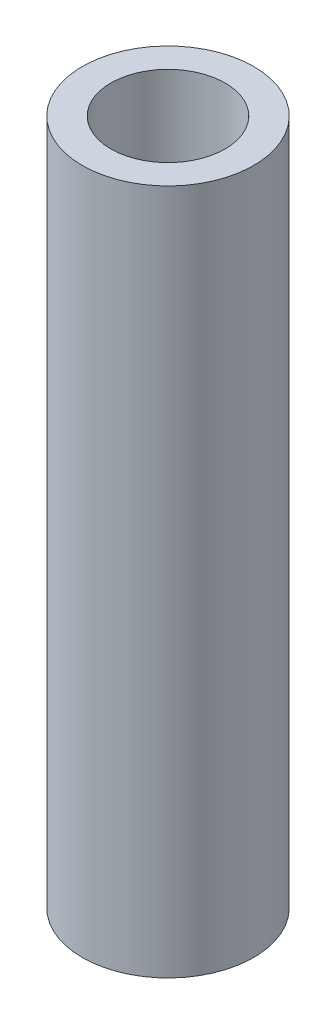
ISO-10303-21;
HEADER;
FILE_DESCRIPTION(('STEP AP214'),'2;1');
FILE_NAME('part.step','',(''),(''),'','','');
FILE_SCHEMA(('AUTOMOTIVE_DESIGN { 1 0 10303 214 1 1 1 1 }'));
ENDSEC;
DATA;
#1=APPLICATION_CONTEXT('core data for automotive mechanical design processes');
#2=APPLICATION_PROTOCOL_DEFINITION('international standard','automotive_design',2000,#1);
#3=PRODUCT_CONTEXT('',#1,'mechanical');
#4=PRODUCT('Part','Part','',(#3));
#5=PRODUCT_RELATED_PRODUCT_CATEGORY('part','',(#4));
#6=PRODUCT_DEFINITION_FORMATION('','',#4);
#7=PRODUCT_DEFINITION_CONTEXT('part definition',#1,'design');
#8=PRODUCT_DEFINITION('design','',#6,#7);
#9=PRODUCT_DEFINITION_SHAPE('','',#8);
#10=(LENGTH_UNIT() NAMED_UNIT(*) SI_UNIT(.MILLI.,.METRE.));
#11=(NAMED_UNIT(*) PLANE_ANGLE_UNIT() SI_UNIT($,.RADIAN.));
#12=(NAMED_UNIT(*) SI_UNIT($,.STERADIAN.) SOLID_ANGLE_UNIT());
#13=UNCERTAINTY_MEASURE_WITH_UNIT(LENGTH_MEASURE(1.E-05),#10,'distance_accuracy_value','');
#14=(GEOMETRIC_REPRESENTATION_CONTEXT(3) GLOBAL_UNCERTAINTY_ASSIGNED_CONTEXT((#13)) GLOBAL_UNIT_ASSIGNED_CONTEXT((#10,
#11,#12)) REPRESENTATION_CONTEXT('',''));
#15=CARTESIAN_POINT('',(0.,0.,0.));
#16=DIRECTION('',(0.,0.,1.));
#17=DIRECTION('',(1.,0.,0.));
#18=AXIS2_PLACEMENT_3D('',#15,#16,#17);
#19=CARTESIAN_POINT('',(0.,60.,0.));
#20=DIRECTION('',(0.,-1.,0.));
#21=DIRECTION('',(0.,0.,-1.));
#22=AXIS2_PLACEMENT_3D('',#19,#20,#21);
#23=CYLINDRICAL_SURFACE('',#22,7.5);
#24=CARTESIAN_POINT('',(0.,19.875,0.));
#25=DIRECTION('',(0.,-1.,0.));
#26=DIRECTION('',(0.,0.,-1.));
#27=AXIS2_PLACEMENT_3D('',#24,#25,#26);
#28=CIRCLE('',#27,7.5);
#29=CARTESIAN_POINT('',(-2.625,19.875,-7.0256227481982));
#30=VERTEX_POINT('',#29);
#31=CARTESIAN_POINT('',(2.625,19.875,-7.0256227481982));
#32=VERTEX_POINT('',#31);
#33=EDGE_CURVE('E113',#30,#32,#28,.T.);
#34=ORIENTED_EDGE('',*,*,#33,.T.);
#35=DIRECTION('',(0.,-1.,0.));
#36=VECTOR('',#35,1.);
#37=CARTESIAN_POINT('',(2.625,60.,-7.0256227481982));
#38=LINE('',#37,#36);
#39=CARTESIAN_POINT('',(2.625,40.125,-7.0256227481982));
#40=VERTEX_POINT('',#39);
#41=EDGE_CURVE('E11',#32,#40,#38,.F.);
#42=ORIENTED_EDGE('',*,*,#41,.T.);
#43=CARTESIAN_POINT('',(0.,40.125,0.));
#44=DIRECTION('',(0.,1.,0.));
#45=DIRECTION('',(0.,0.,1.));
#46=AXIS2_PLACEMENT_3D('',#43,#44,#45);
#47=CIRCLE('',#46,7.5);
#48=CARTESIAN_POINT('',(-2.625,40.125,-7.0256227481982));
#49=VERTEX_POINT('',#48);
#50=EDGE_CURVE('E40',#40,#49,#47,.T.);
#51=ORIENTED_EDGE('',*,*,#50,.T.);
#52=DIRECTION('',(0.,-1.,0.));
#53=VECTOR('',#52,1.);
#54=CARTESIAN_POINT('',(-2.625,60.,-7.0256227481982));
#55=LINE('',#54,#53);
#56=EDGE_CURVE('E54',#49,#30,#55,.T.);
#57=ORIENTED_EDGE('',*,*,#56,.T.);
#58=EDGE_LOOP('',(#34,#42,#51,#57));
#59=FACE_BOUND('',#58,.T.);
#60=CARTESIAN_POINT('',(0.,60.,0.));
#61=DIRECTION('',(0.,1.,0.));
#62=DIRECTION('',(0.,0.,1.));
#63=AXIS2_PLACEMENT_3D('',#60,#61,#62);
#64=CIRCLE('',#63,7.5);
#65=CARTESIAN_POINT('',(0.,60.,7.5));
#66=VERTEX_POINT('',#65);
#67=EDGE_CURVE('E110',#66,#66,#64,.T.);
#68=ORIENTED_EDGE('',*,*,#67,.F.);
#69=EDGE_LOOP('',(#68));
#70=FACE_BOUND('',#69,.T.);
#71=CARTESIAN_POINT('',(0.,0.,0.));
#72=DIRECTION('',(0.,1.,0.));
#73=DIRECTION('',(0.,0.,1.));
#74=AXIS2_PLACEMENT_3D('',#71,#72,#73);
#75=CIRCLE('',#74,7.5);
#76=CARTESIAN_POINT('',(0.,0.,7.5));
#77=VERTEX_POINT('',#76);
#78=EDGE_CURVE('E107',#77,#77,#75,.T.);
#79=ORIENTED_EDGE('',*,*,#78,.T.);
#80=EDGE_LOOP('',(#79));
#81=FACE_BOUND('',#80,.T.);
#82=ADVANCED_FACE('F33',(#59,#70,#81),#23,.T.);
#83=CARTESIAN_POINT('',(0.,60.,0.));
#84=DIRECTION('',(0.,1.,0.));
#85=DIRECTION('',(0.,0.,1.));
#86=AXIS2_PLACEMENT_3D('',#83,#84,#85);
#87=PLANE('',#86);
#88=CARTESIAN_POINT('',(0.,60.,0.));
#89=DIRECTION('',(0.,1.,0.));
#90=DIRECTION('',(0.,0.,1.));
#91=AXIS2_PLACEMENT_3D('',#88,#89,#90);
#92=CIRCLE('',#91,5.);
#93=CARTESIAN_POINT('',(0.,60.,5.));
#94=VERTEX_POINT('',#93);
#95=EDGE_CURVE('E100',#94,#94,#92,.T.);
#96=ORIENTED_EDGE('',*,*,#95,.F.);
#97=EDGE_LOOP('',(#96));
#98=FACE_BOUND('',#97,.T.);
#99=ORIENTED_EDGE('',*,*,#67,.T.);
#100=EDGE_LOOP('',(#99));
#101=FACE_BOUND('',#100,.T.);
#102=ADVANCED_FACE('F132',(#98,#101),#87,.T.);
#103=CARTESIAN_POINT('',(0.,0.,0.));
#104=DIRECTION('',(0.,1.,0.));
#105=DIRECTION('',(0.,0.,1.));
#106=AXIS2_PLACEMENT_3D('',#103,#104,#105);
#107=PLANE('',#106);
#108=ORIENTED_EDGE('',*,*,#78,.F.);
#109=EDGE_LOOP('',(#108));
#110=FACE_BOUND('',#109,.T.);
#111=ADVANCED_FACE('F136',(#110),#107,.F.);
#112=CARTESIAN_POINT('',(0.,45.,0.));
#113=DIRECTION('',(0.,1.,0.));
#114=DIRECTION('',(0.,0.,1.));
#115=AXIS2_PLACEMENT_3D('',#112,#113,#114);
#116=CYLINDRICAL_SURFACE('',#115,5.);
#117=CARTESIAN_POINT('',(0.,45.,0.));
#118=DIRECTION('',(0.,1.,0.));
#119=DIRECTION('',(0.,0.,1.));
#120=AXIS2_PLACEMENT_3D('',#117,#118,#119);
#121=CIRCLE('',#120,5.);
#122=CARTESIAN_POINT('',(0.,45.,5.));
#123=VERTEX_POINT('',#122);
#124=EDGE_CURVE('E104',#123,#123,#121,.T.);
#125=ORIENTED_EDGE('',*,*,#124,.F.);
#126=EDGE_LOOP('',(#125));
#127=FACE_BOUND('',#126,.T.);
#128=ORIENTED_EDGE('',*,*,#95,.T.);
#129=EDGE_LOOP('',(#128));
#130=FACE_BOUND('',#129,.T.);
#131=ADVANCED_FACE('F142',(#127,#130),#116,.F.);
#132=CARTESIAN_POINT('',(0.,45.,0.));
#133=DIRECTION('',(0.,1.,0.));
#134=DIRECTION('',(0.,0.,1.));
#135=AXIS2_PLACEMENT_3D('',#132,#133,#134);
#136=PLANE('',#135);
#137=ORIENTED_EDGE('',*,*,#124,.T.);
#138=EDGE_LOOP('',(#137));
#139=FACE_BOUND('',#138,.T.);
#140=ADVANCED_FACE('F128',(#139),#136,.T.);
#141=CARTESIAN_POINT('',(2.625,19.875,0.));
#142=DIRECTION('',(1.,0.,0.));
#143=DIRECTION('',(0.,1.,0.));
#144=AXIS2_PLACEMENT_3D('',#141,#142,#143);
#145=PLANE('',#144);
#146=DIRECTION('',(0.,0.,-1.));
#147=VECTOR('',#146,1.);
#148=CARTESIAN_POINT('',(2.625,19.875,0.));
#149=LINE('',#148,#147);
#150=CARTESIAN_POINT('',(2.625,19.875,0.));
#151=VERTEX_POINT('',#150);
#152=EDGE_CURVE('E74',#151,#32,#149,.T.);
#153=ORIENTED_EDGE('',*,*,#152,.F.);
#154=DIRECTION('',(0.,-1.,0.));
#155=VECTOR('',#154,1.);
#156=CARTESIAN_POINT('',(2.625,19.875,0.));
#157=LINE('',#156,#155);
#158=CARTESIAN_POINT('',(2.625,40.125,0.));
#159=VERTEX_POINT('',#158);
#160=EDGE_CURVE('E78',#159,#151,#157,.T.);
#161=ORIENTED_EDGE('',*,*,#160,.F.);
#162=DIRECTION('',(0.,0.,-1.));
#163=VECTOR('',#162,1.);
#164=CARTESIAN_POINT('',(2.625,40.125,0.));
#165=LINE('',#164,#163);
#166=EDGE_CURVE('E98',#159,#40,#165,.T.);
#167=ORIENTED_EDGE('',*,*,#166,.T.);
#168=ORIENTED_EDGE('',*,*,#41,.F.);
#169=EDGE_LOOP('',(#153,#161,#167,#168));
#170=FACE_BOUND('',#169,.T.);
#171=ADVANCED_FACE('F76',(#170),#145,.F.);
#172=CARTESIAN_POINT('',(-2.625,40.125,0.));
#173=DIRECTION('',(0.,1.,0.));
#174=DIRECTION('',(0.,0.,1.));
#175=AXIS2_PLACEMENT_3D('',#172,#173,#174);
#176=PLANE('',#175);
#177=ORIENTED_EDGE('',*,*,#166,.F.);
#178=DIRECTION('',(1.,0.,0.));
#179=VECTOR('',#178,1.);
#180=CARTESIAN_POINT('',(-2.625,40.125,0.));
#181=LINE('',#180,#179);
#182=CARTESIAN_POINT('',(-2.625,40.125,0.));
#183=VERTEX_POINT('',#182);
#184=EDGE_CURVE('E82',#183,#159,#181,.T.);
#185=ORIENTED_EDGE('',*,*,#184,.F.);
#186=DIRECTION('',(0.,0.,-1.));
#187=VECTOR('',#186,1.);
#188=CARTESIAN_POINT('',(-2.625,40.125,0.));
#189=LINE('',#188,#187);
#190=EDGE_CURVE('E101',#183,#49,#189,.T.);
#191=ORIENTED_EDGE('',*,*,#190,.T.);
#192=ORIENTED_EDGE('',*,*,#50,.F.);
#193=EDGE_LOOP('',(#177,#185,#191,#192));
#194=FACE_BOUND('',#193,.T.);
#195=ADVANCED_FACE('F120',(#194),#176,.F.);
#196=CARTESIAN_POINT('',(-2.625,19.875,0.));
#197=DIRECTION('',(-1.,0.,0.));
#198=DIRECTION('',(0.,0.,1.));
#199=AXIS2_PLACEMENT_3D('',#196,#197,#198);
#200=PLANE('',#199);
#201=ORIENTED_EDGE('',*,*,#190,.F.);
#202=DIRECTION('',(0.,1.,0.));
#203=VECTOR('',#202,1.);
#204=CARTESIAN_POINT('',(-2.625,19.875,0.));
#205=LINE('',#204,#203);
#206=CARTESIAN_POINT('',(-2.625,19.875,0.));
#207=VERTEX_POINT('',#206);
#208=EDGE_CURVE('E90',#207,#183,#205,.T.);
#209=ORIENTED_EDGE('',*,*,#208,.F.);
#210=DIRECTION('',(0.,0.,-1.));
#211=VECTOR('',#210,1.);
#212=CARTESIAN_POINT('',(-2.625,19.875,0.));
#213=LINE('',#212,#211);
#214=EDGE_CURVE('E81',#207,#30,#213,.T.);
#215=ORIENTED_EDGE('',*,*,#214,.T.);
#216=ORIENTED_EDGE('',*,*,#56,.F.);
#217=EDGE_LOOP('',(#201,#209,#215,#216));
#218=FACE_BOUND('',#217,.T.);
#219=ADVANCED_FACE('F119',(#218),#200,.F.);
#220=CARTESIAN_POINT('',(-2.625,19.875,0.));
#221=DIRECTION('',(0.,-1.,0.));
#222=DIRECTION('',(0.,0.,-1.));
#223=AXIS2_PLACEMENT_3D('',#220,#221,#222);
#224=PLANE('',#223);
#225=ORIENTED_EDGE('',*,*,#33,.F.);
#226=ORIENTED_EDGE('',*,*,#214,.F.);
#227=DIRECTION('',(-1.,0.,0.));
#228=VECTOR('',#227,1.);
#229=CARTESIAN_POINT('',(-2.625,19.875,0.));
#230=LINE('',#229,#228);
#231=EDGE_CURVE('E85',#151,#207,#230,.T.);
#232=ORIENTED_EDGE('',*,*,#231,.F.);
#233=ORIENTED_EDGE('',*,*,#152,.T.);
#234=EDGE_LOOP('',(#225,#226,#232,#233));
#235=FACE_BOUND('',#234,.T.);
#236=ADVANCED_FACE('F86',(#235),#224,.F.);
#237=CARTESIAN_POINT('',(0.,0.,0.));
#238=DIRECTION('',(0.,0.,-1.));
#239=DIRECTION('',(-1.,0.,0.));
#240=AXIS2_PLACEMENT_3D('',#237,#238,#239);
#241=PLANE('',#240);
#242=ORIENTED_EDGE('',*,*,#160,.T.);
#243=ORIENTED_EDGE('',*,*,#231,.T.);
#244=ORIENTED_EDGE('',*,*,#208,.T.);
#245=ORIENTED_EDGE('',*,*,#184,.T.);
#246=EDGE_LOOP('',(#242,#243,#244,#245));
#247=FACE_BOUND('',#246,.T.);
#248=ADVANCED_FACE('F92',(#247),#241,.T.);
#249=CLOSED_SHELL('',(#82,#102,#111,#131,#140,#171,#195,#219,#236,#248));
#250=MANIFOLD_SOLID_BREP('B2',#249);
#251=ADVANCED_BREP_SHAPE_REPRESENTATION('',(#18,#250),#14);
#252=SHAPE_DEFINITION_REPRESENTATION(#9,#251);
ENDSEC;
END-ISO-10303-21;
